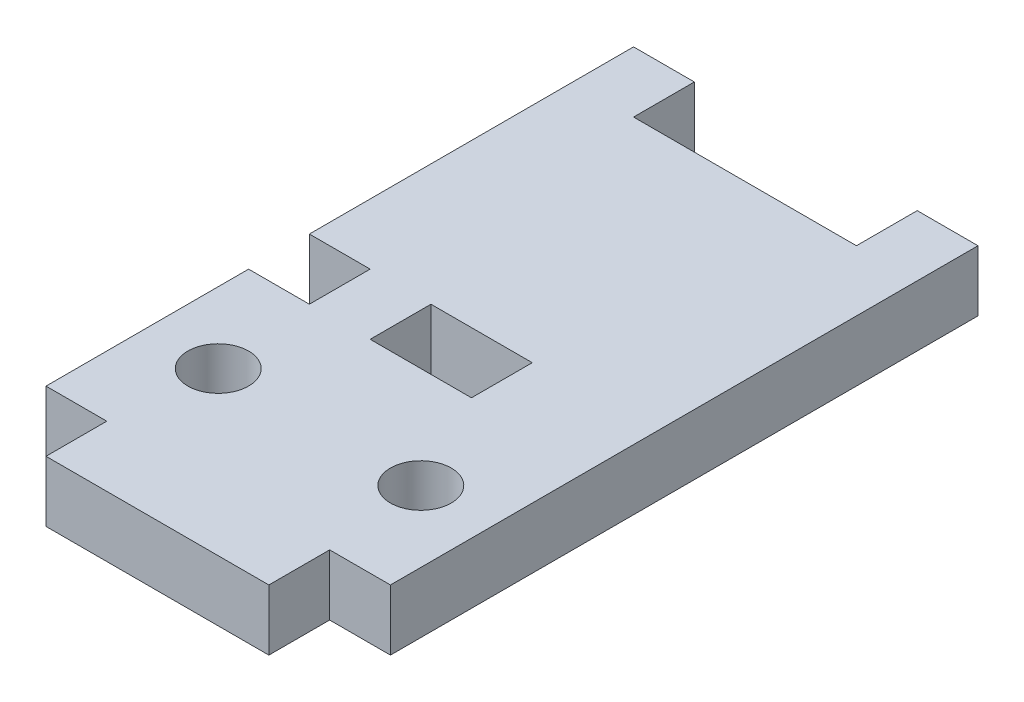
ISO-10303-21;
HEADER;
FILE_DESCRIPTION(('STEP AP214'),'2;1');
FILE_NAME('part.step','',(''),(''),'','','');
FILE_SCHEMA(('AUTOMOTIVE_DESIGN { 1 0 10303 214 1 1 1 1 }'));
ENDSEC;
DATA;
#1=APPLICATION_CONTEXT('core data for automotive mechanical design processes');
#2=APPLICATION_PROTOCOL_DEFINITION('international standard','automotive_design',2000,#1);
#3=PRODUCT_CONTEXT('',#1,'mechanical');
#4=PRODUCT('Part','Part','',(#3));
#5=PRODUCT_RELATED_PRODUCT_CATEGORY('part','',(#4));
#6=PRODUCT_DEFINITION_FORMATION('','',#4);
#7=PRODUCT_DEFINITION_CONTEXT('part definition',#1,'design');
#8=PRODUCT_DEFINITION('design','',#6,#7);
#9=PRODUCT_DEFINITION_SHAPE('','',#8);
#10=(LENGTH_UNIT() NAMED_UNIT(*) SI_UNIT(.MILLI.,.METRE.));
#11=(NAMED_UNIT(*) PLANE_ANGLE_UNIT() SI_UNIT($,.RADIAN.));
#12=(NAMED_UNIT(*) SI_UNIT($,.STERADIAN.) SOLID_ANGLE_UNIT());
#13=UNCERTAINTY_MEASURE_WITH_UNIT(LENGTH_MEASURE(1.E-05),#10,'distance_accuracy_value','');
#14=(GEOMETRIC_REPRESENTATION_CONTEXT(3) GLOBAL_UNCERTAINTY_ASSIGNED_CONTEXT((#13)) GLOBAL_UNIT_ASSIGNED_CONTEXT((#10,
#11,#12)) REPRESENTATION_CONTEXT('',''));
#15=CARTESIAN_POINT('',(0.,0.,0.));
#16=DIRECTION('',(0.,0.,1.));
#17=DIRECTION('',(1.,0.,0.));
#18=AXIS2_PLACEMENT_3D('',#15,#16,#17);
#19=CARTESIAN_POINT('',(-8.5,1.5,-14.5));
#20=DIRECTION('',(1.,0.,0.));
#21=DIRECTION('',(0.,0.,-1.));
#22=AXIS2_PLACEMENT_3D('',#19,#20,#21);
#23=PLANE('',#22);
#24=DIRECTION('',(0.,0.,1.));
#25=VECTOR('',#24,1.);
#26=CARTESIAN_POINT('',(-8.5,-1.5,-14.5));
#27=LINE('',#26,#25);
#28=CARTESIAN_POINT('',(-8.5,-1.5,-14.5));
#29=VERTEX_POINT('',#28);
#30=CARTESIAN_POINT('',(-8.5,-1.5,1.5));
#31=VERTEX_POINT('',#30);
#32=EDGE_CURVE('E308',#29,#31,#27,.T.);
#33=ORIENTED_EDGE('',*,*,#32,.T.);
#34=DIRECTION('',(0.,1.,0.));
#35=VECTOR('',#34,1.);
#36=CARTESIAN_POINT('',(-8.5,-1.5,1.5));
#37=LINE('',#36,#35);
#38=CARTESIAN_POINT('',(-8.5,1.5,1.5));
#39=VERTEX_POINT('',#38);
#40=EDGE_CURVE('E193',#31,#39,#37,.T.);
#41=ORIENTED_EDGE('',*,*,#40,.T.);
#42=DIRECTION('',(0.,0.,1.));
#43=VECTOR('',#42,1.);
#44=CARTESIAN_POINT('',(-8.5,1.5,-14.5));
#45=LINE('',#44,#43);
#46=CARTESIAN_POINT('',(-8.5,1.5,-14.5));
#47=VERTEX_POINT('',#46);
#48=EDGE_CURVE('E294',#47,#39,#45,.T.);
#49=ORIENTED_EDGE('',*,*,#48,.F.);
#50=DIRECTION('',(0.,-1.,0.));
#51=VECTOR('',#50,1.);
#52=CARTESIAN_POINT('',(-8.5,1.5,-14.5));
#53=LINE('',#52,#51);
#54=EDGE_CURVE('E307',#47,#29,#53,.T.);
#55=ORIENTED_EDGE('',*,*,#54,.T.);
#56=EDGE_LOOP('',(#33,#41,#49,#55));
#57=FACE_BOUND('',#56,.T.);
#58=ADVANCED_FACE('F35',(#57),#23,.F.);
#59=CARTESIAN_POINT('',(-8.5,1.5,-14.5));
#60=DIRECTION('',(0.,0.,1.));
#61=DIRECTION('',(1.,0.,0.));
#62=AXIS2_PLACEMENT_3D('',#59,#60,#61);
#63=PLANE('',#62);
#64=DIRECTION('',(-1.,0.,0.));
#65=VECTOR('',#64,1.);
#66=CARTESIAN_POINT('',(-8.5,1.5,-14.5));
#67=LINE('',#66,#65);
#68=CARTESIAN_POINT('',(-5.5,1.5,-14.5));
#69=VERTEX_POINT('',#68);
#70=EDGE_CURVE('E304',#69,#47,#67,.T.);
#71=ORIENTED_EDGE('',*,*,#70,.F.);
#72=DIRECTION('',(0.,1.,0.));
#73=VECTOR('',#72,1.);
#74=CARTESIAN_POINT('',(-5.5,-1.5,-14.5));
#75=LINE('',#74,#73);
#76=CARTESIAN_POINT('',(-5.5,-1.5,-14.5));
#77=VERTEX_POINT('',#76);
#78=EDGE_CURVE('E190',#77,#69,#75,.T.);
#79=ORIENTED_EDGE('',*,*,#78,.F.);
#80=DIRECTION('',(-1.,0.,0.));
#81=VECTOR('',#80,1.);
#82=CARTESIAN_POINT('',(-8.5,-1.5,-14.5));
#83=LINE('',#82,#81);
#84=EDGE_CURVE('E317',#77,#29,#83,.T.);
#85=ORIENTED_EDGE('',*,*,#84,.T.);
#86=ORIENTED_EDGE('',*,*,#54,.F.);
#87=EDGE_LOOP('',(#71,#79,#85,#86));
#88=FACE_BOUND('',#87,.T.);
#89=ADVANCED_FACE('F379',(#88),#63,.F.);
#90=CARTESIAN_POINT('',(-8.5,1.5,14.5));
#91=DIRECTION('',(0.,0.,-1.));
#92=DIRECTION('',(-1.,0.,0.));
#93=AXIS2_PLACEMENT_3D('',#90,#91,#92);
#94=PLANE('',#93);
#95=DIRECTION('',(0.,-1.,0.));
#96=VECTOR('',#95,1.);
#97=CARTESIAN_POINT('',(-5.50000000000001,1.5,14.5));
#98=LINE('',#97,#96);
#99=CARTESIAN_POINT('',(-5.50000000000001,1.5,14.5));
#100=VERTEX_POINT('',#99);
#101=CARTESIAN_POINT('',(-5.50000000000001,-1.5,14.5));
#102=VERTEX_POINT('',#101);
#103=EDGE_CURVE('E277',#100,#102,#98,.T.);
#104=ORIENTED_EDGE('',*,*,#103,.F.);
#105=DIRECTION('',(1.,0.,0.));
#106=VECTOR('',#105,1.);
#107=CARTESIAN_POINT('',(-8.5,1.5,14.5));
#108=LINE('',#107,#106);
#109=CARTESIAN_POINT('',(-8.5,1.5,14.5));
#110=VERTEX_POINT('',#109);
#111=EDGE_CURVE('E299',#110,#100,#108,.T.);
#112=ORIENTED_EDGE('',*,*,#111,.F.);
#113=DIRECTION('',(0.,-1.,0.));
#114=VECTOR('',#113,1.);
#115=CARTESIAN_POINT('',(-8.5,1.5,14.5));
#116=LINE('',#115,#114);
#117=CARTESIAN_POINT('',(-8.5,-1.5,14.5));
#118=VERTEX_POINT('',#117);
#119=EDGE_CURVE('E11',#110,#118,#116,.T.);
#120=ORIENTED_EDGE('',*,*,#119,.T.);
#121=DIRECTION('',(1.,0.,0.));
#122=VECTOR('',#121,1.);
#123=CARTESIAN_POINT('',(-8.5,-1.5,14.5));
#124=LINE('',#123,#122);
#125=EDGE_CURVE('E312',#118,#102,#124,.T.);
#126=ORIENTED_EDGE('',*,*,#125,.T.);
#127=EDGE_LOOP('',(#104,#112,#120,#126));
#128=FACE_BOUND('',#127,.T.);
#129=ADVANCED_FACE('F359',(#128),#94,.F.);
#130=CARTESIAN_POINT('',(-8.5,1.5,4.5));
#131=VERTEX_POINT('',#130);
#132=EDGE_CURVE('E298',#131,#110,#45,.T.);
#133=ORIENTED_EDGE('',*,*,#132,.F.);
#134=DIRECTION('',(0.,1.,0.));
#135=VECTOR('',#134,1.);
#136=CARTESIAN_POINT('',(-8.5,-1.5,4.5));
#137=LINE('',#136,#135);
#138=CARTESIAN_POINT('',(-8.5,-1.5,4.5));
#139=VERTEX_POINT('',#138);
#140=EDGE_CURVE('E230',#139,#131,#137,.T.);
#141=ORIENTED_EDGE('',*,*,#140,.F.);
#142=EDGE_CURVE('E293',#139,#118,#27,.T.);
#143=ORIENTED_EDGE('',*,*,#142,.T.);
#144=ORIENTED_EDGE('',*,*,#119,.F.);
#145=EDGE_LOOP('',(#133,#141,#143,#144));
#146=FACE_BOUND('',#145,.T.);
#147=ADVANCED_FACE('F37',(#146),#23,.F.);
#148=CARTESIAN_POINT('',(5.50000000000001,1.5,14.5));
#149=VERTEX_POINT('',#148);
#150=CARTESIAN_POINT('',(8.5,1.5,14.5));
#151=VERTEX_POINT('',#150);
#152=EDGE_CURVE('E297',#149,#151,#108,.T.);
#153=ORIENTED_EDGE('',*,*,#152,.F.);
#154=DIRECTION('',(0.,-1.,0.));
#155=VECTOR('',#154,1.);
#156=CARTESIAN_POINT('',(5.50000000000001,1.5,14.5));
#157=LINE('',#156,#155);
#158=CARTESIAN_POINT('',(5.50000000000001,-1.5,14.5));
#159=VERTEX_POINT('',#158);
#160=EDGE_CURVE('E284',#149,#159,#157,.T.);
#161=ORIENTED_EDGE('',*,*,#160,.T.);
#162=CARTESIAN_POINT('',(8.5,-1.5,14.5));
#163=VERTEX_POINT('',#162);
#164=EDGE_CURVE('E311',#159,#163,#124,.T.);
#165=ORIENTED_EDGE('',*,*,#164,.T.);
#166=DIRECTION('',(0.,-1.,0.));
#167=VECTOR('',#166,1.);
#168=CARTESIAN_POINT('',(8.5,1.5,14.5));
#169=LINE('',#168,#167);
#170=EDGE_CURVE('E43',#151,#163,#169,.T.);
#171=ORIENTED_EDGE('',*,*,#170,.F.);
#172=EDGE_LOOP('',(#153,#161,#165,#171));
#173=FACE_BOUND('',#172,.T.);
#174=ADVANCED_FACE('F345',(#173),#94,.F.);
#175=CARTESIAN_POINT('',(8.5,1.5,-14.5));
#176=DIRECTION('',(-1.,0.,0.));
#177=DIRECTION('',(0.,0.,1.));
#178=AXIS2_PLACEMENT_3D('',#175,#176,#177);
#179=PLANE('',#178);
#180=DIRECTION('',(0.,0.,-1.));
#181=VECTOR('',#180,1.);
#182=CARTESIAN_POINT('',(8.5,-1.5,-14.5));
#183=LINE('',#182,#181);
#184=CARTESIAN_POINT('',(8.5,-1.5,-14.5));
#185=VERTEX_POINT('',#184);
#186=EDGE_CURVE('E315',#163,#185,#183,.T.);
#187=ORIENTED_EDGE('',*,*,#186,.T.);
#188=DIRECTION('',(0.,-1.,0.));
#189=VECTOR('',#188,1.);
#190=CARTESIAN_POINT('',(8.5,1.5,-14.5));
#191=LINE('',#190,#189);
#192=CARTESIAN_POINT('',(8.5,1.5,-14.5));
#193=VERTEX_POINT('',#192);
#194=EDGE_CURVE('E323',#193,#185,#191,.T.);
#195=ORIENTED_EDGE('',*,*,#194,.F.);
#196=DIRECTION('',(0.,0.,-1.));
#197=VECTOR('',#196,1.);
#198=CARTESIAN_POINT('',(8.5,1.5,-14.5));
#199=LINE('',#198,#197);
#200=EDGE_CURVE('E302',#151,#193,#199,.T.);
#201=ORIENTED_EDGE('',*,*,#200,.F.);
#202=ORIENTED_EDGE('',*,*,#170,.T.);
#203=EDGE_LOOP('',(#187,#195,#201,#202));
#204=FACE_BOUND('',#203,.T.);
#205=ADVANCED_FACE('F330',(#204),#179,.F.);
#206=CARTESIAN_POINT('',(5.5,-1.5,-14.5));
#207=VERTEX_POINT('',#206);
#208=EDGE_CURVE('E318',#185,#207,#83,.T.);
#209=ORIENTED_EDGE('',*,*,#208,.T.);
#210=DIRECTION('',(0.,1.,0.));
#211=VECTOR('',#210,1.);
#212=CARTESIAN_POINT('',(5.5,-1.5,-14.5));
#213=LINE('',#212,#211);
#214=CARTESIAN_POINT('',(5.5,1.5,-14.5));
#215=VERTEX_POINT('',#214);
#216=EDGE_CURVE('E210',#207,#215,#213,.T.);
#217=ORIENTED_EDGE('',*,*,#216,.T.);
#218=EDGE_CURVE('E305',#193,#215,#67,.T.);
#219=ORIENTED_EDGE('',*,*,#218,.F.);
#220=ORIENTED_EDGE('',*,*,#194,.T.);
#221=EDGE_LOOP('',(#209,#217,#219,#220));
#222=FACE_BOUND('',#221,.T.);
#223=ADVANCED_FACE('F341',(#222),#63,.F.);
#224=CARTESIAN_POINT('',(0.,1.5,0.));
#225=DIRECTION('',(0.,1.,0.));
#226=DIRECTION('',(0.,0.,1.));
#227=AXIS2_PLACEMENT_3D('',#224,#225,#226);
#228=PLANE('',#227);
#229=CARTESIAN_POINT('',(-5.,1.5,9.5));
#230=DIRECTION('',(0.,1.,0.));
#231=DIRECTION('',(0.,0.,1.));
#232=AXIS2_PLACEMENT_3D('',#229,#230,#231);
#233=CIRCLE('',#232,1.5);
#234=CARTESIAN_POINT('',(-5.,1.5,11.));
#235=VERTEX_POINT('',#234);
#236=EDGE_CURVE('E575',#235,#235,#233,.T.);
#237=ORIENTED_EDGE('',*,*,#236,.F.);
#238=EDGE_LOOP('',(#237));
#239=FACE_BOUND('',#238,.T.);
#240=CARTESIAN_POINT('',(5.,1.5,9.5));
#241=DIRECTION('',(0.,1.,0.));
#242=DIRECTION('',(0.,0.,-1.));
#243=AXIS2_PLACEMENT_3D('',#240,#241,#242);
#244=CIRCLE('',#243,1.5);
#245=CARTESIAN_POINT('',(5.,1.5,8.));
#246=VERTEX_POINT('',#245);
#247=EDGE_CURVE('E576',#246,#246,#244,.T.);
#248=ORIENTED_EDGE('',*,*,#247,.F.);
#249=EDGE_LOOP('',(#248));
#250=FACE_BOUND('',#249,.T.);
#251=DIRECTION('',(-1.,0.,0.));
#252=VECTOR('',#251,1.);
#253=CARTESIAN_POINT('',(-8.5,1.5,1.5));
#254=LINE('',#253,#252);
#255=CARTESIAN_POINT('',(-5.5,1.5,1.5));
#256=VERTEX_POINT('',#255);
#257=EDGE_CURVE('E221',#256,#39,#254,.T.);
#258=ORIENTED_EDGE('',*,*,#257,.F.);
#259=DIRECTION('',(0.,0.,-1.));
#260=VECTOR('',#259,1.);
#261=CARTESIAN_POINT('',(-5.5,1.5,1.5));
#262=LINE('',#261,#260);
#263=CARTESIAN_POINT('',(-5.5,1.5,4.5));
#264=VERTEX_POINT('',#263);
#265=EDGE_CURVE('E217',#264,#256,#262,.T.);
#266=ORIENTED_EDGE('',*,*,#265,.F.);
#267=DIRECTION('',(1.,0.,0.));
#268=VECTOR('',#267,1.);
#269=CARTESIAN_POINT('',(-8.5,1.5,4.5));
#270=LINE('',#269,#268);
#271=EDGE_CURVE('E214',#131,#264,#270,.T.);
#272=ORIENTED_EDGE('',*,*,#271,.F.);
#273=ORIENTED_EDGE('',*,*,#132,.T.);
#274=ORIENTED_EDGE('',*,*,#111,.T.);
#275=DIRECTION('',(0.,0.,1.));
#276=VECTOR('',#275,1.);
#277=CARTESIAN_POINT('',(-5.50000000000001,1.5,14.5));
#278=LINE('',#277,#276);
#279=CARTESIAN_POINT('',(-5.50000000000001,1.5,17.5));
#280=VERTEX_POINT('',#279);
#281=EDGE_CURVE('E269',#100,#280,#278,.T.);
#282=ORIENTED_EDGE('',*,*,#281,.T.);
#283=DIRECTION('',(1.,0.,0.));
#284=VECTOR('',#283,1.);
#285=CARTESIAN_POINT('',(-5.50000000000001,1.5,17.5));
#286=LINE('',#285,#284);
#287=CARTESIAN_POINT('',(5.49999999999999,1.5,17.5));
#288=VERTEX_POINT('',#287);
#289=EDGE_CURVE('E272',#280,#288,#286,.T.);
#290=ORIENTED_EDGE('',*,*,#289,.T.);
#291=DIRECTION('',(0.,0.,-1.));
#292=VECTOR('',#291,1.);
#293=CARTESIAN_POINT('',(5.50000000000001,1.5,14.5));
#294=LINE('',#293,#292);
#295=EDGE_CURVE('E275',#288,#149,#294,.T.);
#296=ORIENTED_EDGE('',*,*,#295,.T.);
#297=ORIENTED_EDGE('',*,*,#152,.T.);
#298=ORIENTED_EDGE('',*,*,#200,.T.);
#299=ORIENTED_EDGE('',*,*,#218,.T.);
#300=DIRECTION('',(0.,0.,-1.));
#301=VECTOR('',#300,1.);
#302=CARTESIAN_POINT('',(5.5,1.5,-14.5));
#303=LINE('',#302,#301);
#304=CARTESIAN_POINT('',(5.5,1.5,-11.5));
#305=VERTEX_POINT('',#304);
#306=EDGE_CURVE('E199',#305,#215,#303,.T.);
#307=ORIENTED_EDGE('',*,*,#306,.F.);
#308=DIRECTION('',(1.,0.,0.));
#309=VECTOR('',#308,1.);
#310=CARTESIAN_POINT('',(-5.5,1.5,-11.5));
#311=LINE('',#310,#309);
#312=CARTESIAN_POINT('',(-5.5,1.5,-11.5));
#313=VERTEX_POINT('',#312);
#314=EDGE_CURVE('E177',#313,#305,#311,.T.);
#315=ORIENTED_EDGE('',*,*,#314,.F.);
#316=DIRECTION('',(0.,0.,1.));
#317=VECTOR('',#316,1.);
#318=CARTESIAN_POINT('',(-5.5,1.5,-14.5));
#319=LINE('',#318,#317);
#320=EDGE_CURVE('E187',#69,#313,#319,.T.);
#321=ORIENTED_EDGE('',*,*,#320,.F.);
#322=ORIENTED_EDGE('',*,*,#70,.T.);
#323=ORIENTED_EDGE('',*,*,#48,.T.);
#324=EDGE_LOOP('',(#258,#266,#272,#273,#274,#282,#290,#296,#297,#298,#299,#307,#315,#321,#322,#323));
#325=FACE_BOUND('',#324,.T.);
#326=DIRECTION('',(0.,0.,1.));
#327=VECTOR('',#326,1.);
#328=CARTESIAN_POINT('',(-2.5,1.5,1.5));
#329=LINE('',#328,#327);
#330=CARTESIAN_POINT('',(-2.5,1.5,1.5));
#331=VERTEX_POINT('',#330);
#332=CARTESIAN_POINT('',(-2.5,1.5,4.5));
#333=VERTEX_POINT('',#332);
#334=EDGE_CURVE('E50',#331,#333,#329,.T.);
#335=ORIENTED_EDGE('',*,*,#334,.F.);
#336=DIRECTION('',(-1.,0.,0.));
#337=VECTOR('',#336,1.);
#338=CARTESIAN_POINT('',(-2.5,1.5,1.5));
#339=LINE('',#338,#337);
#340=CARTESIAN_POINT('',(2.5,1.5,1.5));
#341=VERTEX_POINT('',#340);
#342=EDGE_CURVE('E245',#341,#331,#339,.T.);
#343=ORIENTED_EDGE('',*,*,#342,.F.);
#344=DIRECTION('',(0.,0.,-1.));
#345=VECTOR('',#344,1.);
#346=CARTESIAN_POINT('',(2.5,1.5,1.5));
#347=LINE('',#346,#345);
#348=CARTESIAN_POINT('',(2.5,1.5,4.5));
#349=VERTEX_POINT('',#348);
#350=EDGE_CURVE('E242',#349,#341,#347,.T.);
#351=ORIENTED_EDGE('',*,*,#350,.F.);
#352=DIRECTION('',(1.,0.,0.));
#353=VECTOR('',#352,1.);
#354=CARTESIAN_POINT('',(-2.5,1.5,4.5));
#355=LINE('',#354,#353);
#356=EDGE_CURVE('E239',#333,#349,#355,.T.);
#357=ORIENTED_EDGE('',*,*,#356,.F.);
#358=EDGE_LOOP('',(#335,#343,#351,#357));
#359=FACE_BOUND('',#358,.T.);
#360=ADVANCED_FACE('F196',(#239,#250,#325,#359),#228,.T.);
#361=CARTESIAN_POINT('',(0.,-1.5,0.));
#362=DIRECTION('',(0.,1.,0.));
#363=DIRECTION('',(0.,0.,1.));
#364=AXIS2_PLACEMENT_3D('',#361,#362,#363);
#365=PLANE('',#364);
#366=CARTESIAN_POINT('',(-5.,-1.5,9.5));
#367=DIRECTION('',(0.,1.,0.));
#368=DIRECTION('',(0.,0.,1.));
#369=AXIS2_PLACEMENT_3D('',#366,#367,#368);
#370=CIRCLE('',#369,1.5);
#371=CARTESIAN_POINT('',(-5.,-1.5,11.));
#372=VERTEX_POINT('',#371);
#373=EDGE_CURVE('E218',#372,#372,#370,.T.);
#374=ORIENTED_EDGE('',*,*,#373,.T.);
#375=EDGE_LOOP('',(#374));
#376=FACE_BOUND('',#375,.T.);
#377=CARTESIAN_POINT('',(5.,-1.5,9.5));
#378=DIRECTION('',(0.,1.,0.));
#379=DIRECTION('',(0.,0.,-1.));
#380=AXIS2_PLACEMENT_3D('',#377,#378,#379);
#381=CIRCLE('',#380,1.5);
#382=CARTESIAN_POINT('',(5.,-1.5,8.));
#383=VERTEX_POINT('',#382);
#384=EDGE_CURVE('E574',#383,#383,#381,.T.);
#385=ORIENTED_EDGE('',*,*,#384,.T.);
#386=EDGE_LOOP('',(#385));
#387=FACE_BOUND('',#386,.T.);
#388=DIRECTION('',(0.,0.,-1.));
#389=VECTOR('',#388,1.);
#390=CARTESIAN_POINT('',(-5.5,-1.5,1.5));
#391=LINE('',#390,#389);
#392=CARTESIAN_POINT('',(-5.5,-1.5,4.5));
#393=VERTEX_POINT('',#392);
#394=CARTESIAN_POINT('',(-5.5,-1.5,1.5));
#395=VERTEX_POINT('',#394);
#396=EDGE_CURVE('E58',#393,#395,#391,.T.);
#397=ORIENTED_EDGE('',*,*,#396,.T.);
#398=DIRECTION('',(-1.,0.,0.));
#399=VECTOR('',#398,1.);
#400=CARTESIAN_POINT('',(-8.5,-1.5,1.5));
#401=LINE('',#400,#399);
#402=EDGE_CURVE('E227',#395,#31,#401,.T.);
#403=ORIENTED_EDGE('',*,*,#402,.T.);
#404=ORIENTED_EDGE('',*,*,#32,.F.);
#405=ORIENTED_EDGE('',*,*,#84,.F.);
#406=DIRECTION('',(0.,0.,1.));
#407=VECTOR('',#406,1.);
#408=CARTESIAN_POINT('',(-5.5,-1.5,-14.5));
#409=LINE('',#408,#407);
#410=CARTESIAN_POINT('',(-5.5,-1.5,-11.5));
#411=VERTEX_POINT('',#410);
#412=EDGE_CURVE('E201',#77,#411,#409,.T.);
#413=ORIENTED_EDGE('',*,*,#412,.T.);
#414=DIRECTION('',(1.,0.,0.));
#415=VECTOR('',#414,1.);
#416=CARTESIAN_POINT('',(-5.5,-1.5,-11.5));
#417=LINE('',#416,#415);
#418=CARTESIAN_POINT('',(5.5,-1.5,-11.5));
#419=VERTEX_POINT('',#418);
#420=EDGE_CURVE('E180',#411,#419,#417,.T.);
#421=ORIENTED_EDGE('',*,*,#420,.T.);
#422=DIRECTION('',(0.,0.,-1.));
#423=VECTOR('',#422,1.);
#424=CARTESIAN_POINT('',(5.5,-1.5,-14.5));
#425=LINE('',#424,#423);
#426=EDGE_CURVE('E184',#419,#207,#425,.T.);
#427=ORIENTED_EDGE('',*,*,#426,.T.);
#428=ORIENTED_EDGE('',*,*,#208,.F.);
#429=ORIENTED_EDGE('',*,*,#186,.F.);
#430=ORIENTED_EDGE('',*,*,#164,.F.);
#431=DIRECTION('',(0.,0.,-1.));
#432=VECTOR('',#431,1.);
#433=CARTESIAN_POINT('',(5.50000000000001,-1.5,14.5));
#434=LINE('',#433,#432);
#435=CARTESIAN_POINT('',(5.49999999999999,-1.5,17.5));
#436=VERTEX_POINT('',#435);
#437=EDGE_CURVE('E273',#436,#159,#434,.T.);
#438=ORIENTED_EDGE('',*,*,#437,.F.);
#439=DIRECTION('',(1.,0.,0.));
#440=VECTOR('',#439,1.);
#441=CARTESIAN_POINT('',(-5.50000000000001,-1.5,17.5));
#442=LINE('',#441,#440);
#443=CARTESIAN_POINT('',(-5.50000000000001,-1.5,17.5));
#444=VERTEX_POINT('',#443);
#445=EDGE_CURVE('E280',#444,#436,#442,.T.);
#446=ORIENTED_EDGE('',*,*,#445,.F.);
#447=DIRECTION('',(0.,0.,1.));
#448=VECTOR('',#447,1.);
#449=CARTESIAN_POINT('',(-5.50000000000001,-1.5,14.5));
#450=LINE('',#449,#448);
#451=EDGE_CURVE('E263',#102,#444,#450,.T.);
#452=ORIENTED_EDGE('',*,*,#451,.F.);
#453=ORIENTED_EDGE('',*,*,#125,.F.);
#454=ORIENTED_EDGE('',*,*,#142,.F.);
#455=DIRECTION('',(1.,0.,0.));
#456=VECTOR('',#455,1.);
#457=CARTESIAN_POINT('',(-8.5,-1.5,4.5));
#458=LINE('',#457,#456);
#459=EDGE_CURVE('E223',#139,#393,#458,.T.);
#460=ORIENTED_EDGE('',*,*,#459,.T.);
#461=EDGE_LOOP('',(#397,#403,#404,#405,#413,#421,#427,#428,#429,#430,#438,#446,#452,#453,#454,#460));
#462=FACE_BOUND('',#461,.T.);
#463=DIRECTION('',(-1.,0.,0.));
#464=VECTOR('',#463,1.);
#465=CARTESIAN_POINT('',(-2.5,-1.5,1.5));
#466=LINE('',#465,#464);
#467=CARTESIAN_POINT('',(2.5,-1.5,1.5));
#468=VERTEX_POINT('',#467);
#469=CARTESIAN_POINT('',(-2.5,-1.5,1.5));
#470=VERTEX_POINT('',#469);
#471=EDGE_CURVE('E257',#468,#470,#466,.T.);
#472=ORIENTED_EDGE('',*,*,#471,.T.);
#473=DIRECTION('',(0.,0.,1.));
#474=VECTOR('',#473,1.);
#475=CARTESIAN_POINT('',(-2.5,-1.5,1.5));
#476=LINE('',#475,#474);
#477=CARTESIAN_POINT('',(-2.5,-1.5,4.5));
#478=VERTEX_POINT('',#477);
#479=EDGE_CURVE('E248',#470,#478,#476,.T.);
#480=ORIENTED_EDGE('',*,*,#479,.T.);
#481=DIRECTION('',(1.,0.,0.));
#482=VECTOR('',#481,1.);
#483=CARTESIAN_POINT('',(-2.5,-1.5,4.5));
#484=LINE('',#483,#482);
#485=CARTESIAN_POINT('',(2.5,-1.5,4.5));
#486=VERTEX_POINT('',#485);
#487=EDGE_CURVE('E251',#478,#486,#484,.T.);
#488=ORIENTED_EDGE('',*,*,#487,.T.);
#489=DIRECTION('',(0.,0.,-1.));
#490=VECTOR('',#489,1.);
#491=CARTESIAN_POINT('',(2.5,-1.5,1.5));
#492=LINE('',#491,#490);
#493=EDGE_CURVE('E254',#486,#468,#492,.T.);
#494=ORIENTED_EDGE('',*,*,#493,.T.);
#495=EDGE_LOOP('',(#472,#480,#488,#494));
#496=FACE_BOUND('',#495,.T.);
#497=ADVANCED_FACE('F337',(#376,#387,#462,#496),#365,.F.);
#498=CARTESIAN_POINT('',(-5.50000000000001,1.5,14.5));
#499=DIRECTION('',(1.,0.,0.));
#500=DIRECTION('',(0.,0.,-1.));
#501=AXIS2_PLACEMENT_3D('',#498,#499,#500);
#502=PLANE('',#501);
#503=ORIENTED_EDGE('',*,*,#451,.T.);
#504=DIRECTION('',(0.,-1.,0.));
#505=VECTOR('',#504,1.);
#506=CARTESIAN_POINT('',(-5.50000000000001,1.5,17.5));
#507=LINE('',#506,#505);
#508=EDGE_CURVE('E290',#280,#444,#507,.T.);
#509=ORIENTED_EDGE('',*,*,#508,.F.);
#510=ORIENTED_EDGE('',*,*,#281,.F.);
#511=ORIENTED_EDGE('',*,*,#103,.T.);
#512=EDGE_LOOP('',(#503,#509,#510,#511));
#513=FACE_BOUND('',#512,.T.);
#514=ADVANCED_FACE('F355',(#513),#502,.F.);
#515=CARTESIAN_POINT('',(-5.50000000000001,1.5,17.5));
#516=DIRECTION('',(0.,0.,-1.));
#517=DIRECTION('',(-1.,0.,0.));
#518=AXIS2_PLACEMENT_3D('',#515,#516,#517);
#519=PLANE('',#518);
#520=ORIENTED_EDGE('',*,*,#445,.T.);
#521=DIRECTION('',(0.,-1.,0.));
#522=VECTOR('',#521,1.);
#523=CARTESIAN_POINT('',(5.49999999999999,1.5,17.5));
#524=LINE('',#523,#522);
#525=EDGE_CURVE('E287',#288,#436,#524,.T.);
#526=ORIENTED_EDGE('',*,*,#525,.F.);
#527=ORIENTED_EDGE('',*,*,#289,.F.);
#528=ORIENTED_EDGE('',*,*,#508,.T.);
#529=EDGE_LOOP('',(#520,#526,#527,#528));
#530=FACE_BOUND('',#529,.T.);
#531=ADVANCED_FACE('F353',(#530),#519,.F.);
#532=CARTESIAN_POINT('',(5.50000000000001,1.5,14.5));
#533=DIRECTION('',(-1.,0.,0.));
#534=DIRECTION('',(0.,0.,1.));
#535=AXIS2_PLACEMENT_3D('',#532,#533,#534);
#536=PLANE('',#535);
#537=ORIENTED_EDGE('',*,*,#437,.T.);
#538=ORIENTED_EDGE('',*,*,#160,.F.);
#539=ORIENTED_EDGE('',*,*,#295,.F.);
#540=ORIENTED_EDGE('',*,*,#525,.T.);
#541=EDGE_LOOP('',(#537,#538,#539,#540));
#542=FACE_BOUND('',#541,.T.);
#543=ADVANCED_FACE('F347',(#542),#536,.F.);
#544=CARTESIAN_POINT('',(-2.5,-1.5,1.5));
#545=DIRECTION('',(-1.,0.,0.));
#546=DIRECTION('',(0.,0.,1.));
#547=AXIS2_PLACEMENT_3D('',#544,#545,#546);
#548=PLANE('',#547);
#549=DIRECTION('',(0.,1.,0.));
#550=VECTOR('',#549,1.);
#551=CARTESIAN_POINT('',(-2.5,-1.5,4.5));
#552=LINE('',#551,#550);
#553=EDGE_CURVE('E260',#478,#333,#552,.T.);
#554=ORIENTED_EDGE('',*,*,#553,.F.);
#555=ORIENTED_EDGE('',*,*,#479,.F.);
#556=DIRECTION('',(0.,1.,0.));
#557=VECTOR('',#556,1.);
#558=CARTESIAN_POINT('',(-2.5,-1.5,1.5));
#559=LINE('',#558,#557);
#560=EDGE_CURVE('E261',#470,#331,#559,.T.);
#561=ORIENTED_EDGE('',*,*,#560,.T.);
#562=ORIENTED_EDGE('',*,*,#334,.T.);
#563=EDGE_LOOP('',(#554,#555,#561,#562));
#564=FACE_BOUND('',#563,.T.);
#565=ADVANCED_FACE('F442',(#564),#548,.F.);
#566=CARTESIAN_POINT('',(-2.5,-1.5,1.5));
#567=DIRECTION('',(0.,0.,-1.));
#568=DIRECTION('',(-1.,0.,0.));
#569=AXIS2_PLACEMENT_3D('',#566,#567,#568);
#570=PLANE('',#569);
#571=ORIENTED_EDGE('',*,*,#560,.F.);
#572=ORIENTED_EDGE('',*,*,#471,.F.);
#573=DIRECTION('',(0.,1.,0.));
#574=VECTOR('',#573,1.);
#575=CARTESIAN_POINT('',(2.5,-1.5,1.5));
#576=LINE('',#575,#574);
#577=EDGE_CURVE('E264',#468,#341,#576,.T.);
#578=ORIENTED_EDGE('',*,*,#577,.T.);
#579=ORIENTED_EDGE('',*,*,#342,.T.);
#580=EDGE_LOOP('',(#571,#572,#578,#579));
#581=FACE_BOUND('',#580,.T.);
#582=ADVANCED_FACE('F462',(#581),#570,.F.);
#583=CARTESIAN_POINT('',(2.5,-1.5,1.5));
#584=DIRECTION('',(1.,0.,0.));
#585=DIRECTION('',(0.,0.,-1.));
#586=AXIS2_PLACEMENT_3D('',#583,#584,#585);
#587=PLANE('',#586);
#588=ORIENTED_EDGE('',*,*,#577,.F.);
#589=ORIENTED_EDGE('',*,*,#493,.F.);
#590=DIRECTION('',(0.,1.,0.));
#591=VECTOR('',#590,1.);
#592=CARTESIAN_POINT('',(2.5,-1.5,4.5));
#593=LINE('',#592,#591);
#594=EDGE_CURVE('E266',#486,#349,#593,.T.);
#595=ORIENTED_EDGE('',*,*,#594,.T.);
#596=ORIENTED_EDGE('',*,*,#350,.T.);
#597=EDGE_LOOP('',(#588,#589,#595,#596));
#598=FACE_BOUND('',#597,.T.);
#599=ADVANCED_FACE('F470',(#598),#587,.F.);
#600=CARTESIAN_POINT('',(-2.5,-1.5,4.5));
#601=DIRECTION('',(0.,0.,1.));
#602=DIRECTION('',(1.,0.,0.));
#603=AXIS2_PLACEMENT_3D('',#600,#601,#602);
#604=PLANE('',#603);
#605=ORIENTED_EDGE('',*,*,#594,.F.);
#606=ORIENTED_EDGE('',*,*,#487,.F.);
#607=ORIENTED_EDGE('',*,*,#553,.T.);
#608=ORIENTED_EDGE('',*,*,#356,.T.);
#609=EDGE_LOOP('',(#605,#606,#607,#608));
#610=FACE_BOUND('',#609,.T.);
#611=ADVANCED_FACE('F479',(#610),#604,.F.);
#612=CARTESIAN_POINT('',(-5.5,-1.5,-14.5));
#613=DIRECTION('',(-1.,0.,0.));
#614=DIRECTION('',(0.,0.,1.));
#615=AXIS2_PLACEMENT_3D('',#612,#613,#614);
#616=PLANE('',#615);
#617=DIRECTION('',(0.,1.,0.));
#618=VECTOR('',#617,1.);
#619=CARTESIAN_POINT('',(-5.5,-1.5,-11.5));
#620=LINE('',#619,#618);
#621=EDGE_CURVE('E172',#411,#313,#620,.T.);
#622=ORIENTED_EDGE('',*,*,#621,.F.);
#623=ORIENTED_EDGE('',*,*,#412,.F.);
#624=ORIENTED_EDGE('',*,*,#78,.T.);
#625=ORIENTED_EDGE('',*,*,#320,.T.);
#626=EDGE_LOOP('',(#622,#623,#624,#625));
#627=FACE_BOUND('',#626,.T.);
#628=ADVANCED_FACE('F188',(#627),#616,.F.);
#629=CARTESIAN_POINT('',(5.5,-1.5,-14.5));
#630=DIRECTION('',(1.,0.,0.));
#631=DIRECTION('',(0.,0.,-1.));
#632=AXIS2_PLACEMENT_3D('',#629,#630,#631);
#633=PLANE('',#632);
#634=ORIENTED_EDGE('',*,*,#216,.F.);
#635=ORIENTED_EDGE('',*,*,#426,.F.);
#636=DIRECTION('',(0.,1.,0.));
#637=VECTOR('',#636,1.);
#638=CARTESIAN_POINT('',(5.5,-1.5,-11.5));
#639=LINE('',#638,#637);
#640=EDGE_CURVE('E183',#419,#305,#639,.T.);
#641=ORIENTED_EDGE('',*,*,#640,.T.);
#642=ORIENTED_EDGE('',*,*,#306,.T.);
#643=EDGE_LOOP('',(#634,#635,#641,#642));
#644=FACE_BOUND('',#643,.T.);
#645=ADVANCED_FACE('F496',(#644),#633,.F.);
#646=CARTESIAN_POINT('',(-5.5,-1.5,-11.5));
#647=DIRECTION('',(0.,0.,1.));
#648=DIRECTION('',(1.,0.,0.));
#649=AXIS2_PLACEMENT_3D('',#646,#647,#648);
#650=PLANE('',#649);
#651=ORIENTED_EDGE('',*,*,#640,.F.);
#652=ORIENTED_EDGE('',*,*,#420,.F.);
#653=ORIENTED_EDGE('',*,*,#621,.T.);
#654=ORIENTED_EDGE('',*,*,#314,.T.);
#655=EDGE_LOOP('',(#651,#652,#653,#654));
#656=FACE_BOUND('',#655,.T.);
#657=ADVANCED_FACE('F175',(#656),#650,.F.);
#658=CARTESIAN_POINT('',(-8.5,-1.5,1.5));
#659=DIRECTION('',(0.,0.,-1.));
#660=DIRECTION('',(-1.,0.,0.));
#661=AXIS2_PLACEMENT_3D('',#658,#659,#660);
#662=PLANE('',#661);
#663=ORIENTED_EDGE('',*,*,#40,.F.);
#664=ORIENTED_EDGE('',*,*,#402,.F.);
#665=DIRECTION('',(0.,1.,0.));
#666=VECTOR('',#665,1.);
#667=CARTESIAN_POINT('',(-5.5,-1.5,1.5));
#668=LINE('',#667,#666);
#669=EDGE_CURVE('E233',#395,#256,#668,.T.);
#670=ORIENTED_EDGE('',*,*,#669,.T.);
#671=ORIENTED_EDGE('',*,*,#257,.T.);
#672=EDGE_LOOP('',(#663,#664,#670,#671));
#673=FACE_BOUND('',#672,.T.);
#674=ADVANCED_FACE('F373',(#673),#662,.F.);
#675=CARTESIAN_POINT('',(-5.5,-1.5,1.5));
#676=DIRECTION('',(1.,0.,0.));
#677=DIRECTION('',(0.,0.,-1.));
#678=AXIS2_PLACEMENT_3D('',#675,#676,#677);
#679=PLANE('',#678);
#680=ORIENTED_EDGE('',*,*,#669,.F.);
#681=ORIENTED_EDGE('',*,*,#396,.F.);
#682=DIRECTION('',(0.,1.,0.));
#683=VECTOR('',#682,1.);
#684=CARTESIAN_POINT('',(-5.5,-1.5,4.5));
#685=LINE('',#684,#683);
#686=EDGE_CURVE('E235',#393,#264,#685,.T.);
#687=ORIENTED_EDGE('',*,*,#686,.T.);
#688=ORIENTED_EDGE('',*,*,#265,.T.);
#689=EDGE_LOOP('',(#680,#681,#687,#688));
#690=FACE_BOUND('',#689,.T.);
#691=ADVANCED_FACE('F369',(#690),#679,.F.);
#692=CARTESIAN_POINT('',(-8.5,-1.5,4.5));
#693=DIRECTION('',(0.,0.,1.));
#694=DIRECTION('',(1.,0.,0.));
#695=AXIS2_PLACEMENT_3D('',#692,#693,#694);
#696=PLANE('',#695);
#697=ORIENTED_EDGE('',*,*,#686,.F.);
#698=ORIENTED_EDGE('',*,*,#459,.F.);
#699=ORIENTED_EDGE('',*,*,#140,.T.);
#700=ORIENTED_EDGE('',*,*,#271,.T.);
#701=EDGE_LOOP('',(#697,#698,#699,#700));
#702=FACE_BOUND('',#701,.T.);
#703=ADVANCED_FACE('F368',(#702),#696,.F.);
#704=CARTESIAN_POINT('',(5.,-1.5,9.5));
#705=DIRECTION('',(0.,1.,0.));
#706=DIRECTION('',(0.,0.,1.));
#707=AXIS2_PLACEMENT_3D('',#704,#705,#706);
#708=CYLINDRICAL_SURFACE('',#707,1.5);
#709=ORIENTED_EDGE('',*,*,#384,.F.);
#710=EDGE_LOOP('',(#709));
#711=FACE_BOUND('',#710,.T.);
#712=ORIENTED_EDGE('',*,*,#247,.T.);
#713=EDGE_LOOP('',(#712));
#714=FACE_BOUND('',#713,.T.);
#715=ADVANCED_FACE('F533',(#711,#714),#708,.F.);
#716=CARTESIAN_POINT('',(-5.,-1.5,9.5));
#717=DIRECTION('',(0.,1.,0.));
#718=DIRECTION('',(0.,0.,1.));
#719=AXIS2_PLACEMENT_3D('',#716,#717,#718);
#720=CYLINDRICAL_SURFACE('',#719,1.5);
#721=ORIENTED_EDGE('',*,*,#373,.F.);
#722=EDGE_LOOP('',(#721));
#723=FACE_BOUND('',#722,.T.);
#724=ORIENTED_EDGE('',*,*,#236,.T.);
#725=EDGE_LOOP('',(#724));
#726=FACE_BOUND('',#725,.T.);
#727=ADVANCED_FACE('F542',(#723,#726),#720,.F.);
#728=CLOSED_SHELL('',(#58,#89,#129,#147,#174,#205,#223,#360,#497,#514,#531,#543,#565,#582,#599,
#611,#628,#645,#657,#674,#691,#703,#715,#727));
#729=MANIFOLD_SOLID_BREP('B2',#728);
#730=ADVANCED_BREP_SHAPE_REPRESENTATION('',(#18,#729),#14);
#731=SHAPE_DEFINITION_REPRESENTATION(#9,#730);
ENDSEC;
END-ISO-10303-21;
